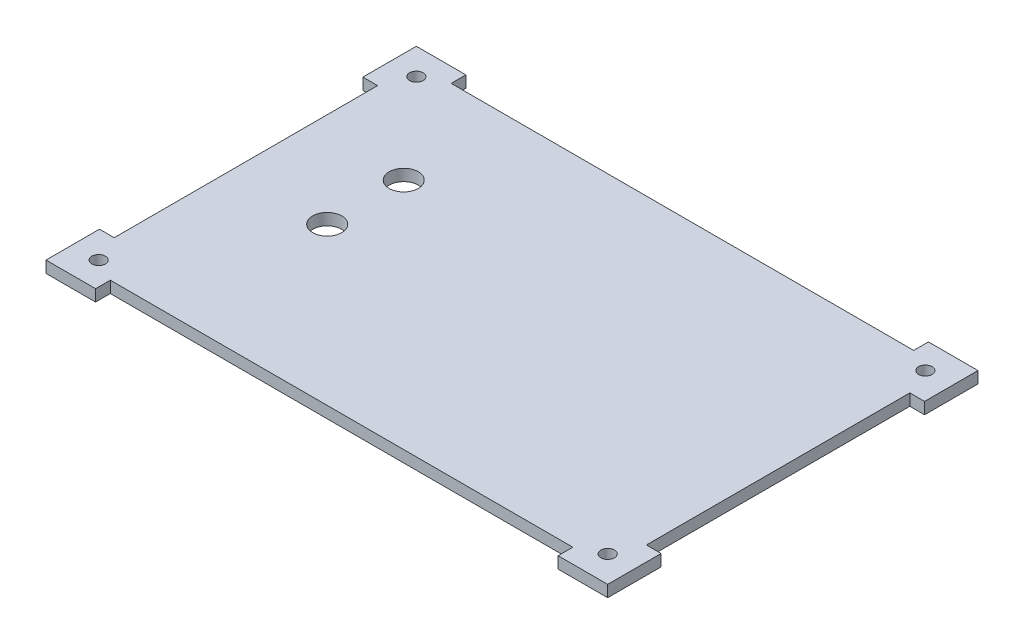
ISO-10303-21;
HEADER;
FILE_DESCRIPTION(('STEP AP214'),'2;1');
FILE_NAME('part.step','',(''),(''),'','','');
FILE_SCHEMA(('AUTOMOTIVE_DESIGN { 1 0 10303 214 1 1 1 1 }'));
ENDSEC;
DATA;
#1=APPLICATION_CONTEXT('core data for automotive mechanical design processes');
#2=APPLICATION_PROTOCOL_DEFINITION('international standard','automotive_design',2000,#1);
#3=PRODUCT_CONTEXT('',#1,'mechanical');
#4=PRODUCT('Part','Part','',(#3));
#5=PRODUCT_RELATED_PRODUCT_CATEGORY('part','',(#4));
#6=PRODUCT_DEFINITION_FORMATION('','',#4);
#7=PRODUCT_DEFINITION_CONTEXT('part definition',#1,'design');
#8=PRODUCT_DEFINITION('design','',#6,#7);
#9=PRODUCT_DEFINITION_SHAPE('','',#8);
#10=(LENGTH_UNIT() NAMED_UNIT(*) SI_UNIT(.MILLI.,.METRE.));
#11=(NAMED_UNIT(*) PLANE_ANGLE_UNIT() SI_UNIT($,.RADIAN.));
#12=(NAMED_UNIT(*) SI_UNIT($,.STERADIAN.) SOLID_ANGLE_UNIT());
#13=UNCERTAINTY_MEASURE_WITH_UNIT(LENGTH_MEASURE(1.E-05),#10,'distance_accuracy_value','');
#14=(GEOMETRIC_REPRESENTATION_CONTEXT(3) GLOBAL_UNCERTAINTY_ASSIGNED_CONTEXT((#13)) GLOBAL_UNIT_ASSIGNED_CONTEXT((#10,
#11,#12)) REPRESENTATION_CONTEXT('',''));
#15=CARTESIAN_POINT('',(0.,0.,0.));
#16=DIRECTION('',(0.,0.,1.));
#17=DIRECTION('',(1.,0.,0.));
#18=AXIS2_PLACEMENT_3D('',#15,#16,#17);
#19=CARTESIAN_POINT('',(0.,3.,88.));
#20=DIRECTION('',(0.,0.,-1.));
#21=DIRECTION('',(-1.,0.,0.));
#22=AXIS2_PLACEMENT_3D('',#19,#20,#21);
#23=PLANE('',#22);
#24=DIRECTION('',(0.,-1.,0.));
#25=VECTOR('',#24,1.);
#26=CARTESIAN_POINT('',(128.4,3.,88.));
#27=LINE('',#26,#25);
#28=CARTESIAN_POINT('',(128.4,3.,88.));
#29=VERTEX_POINT('',#28);
#30=CARTESIAN_POINT('',(128.4,0.,88.));
#31=VERTEX_POINT('',#30);
#32=EDGE_CURVE('E65',#29,#31,#27,.T.);
#33=ORIENTED_EDGE('',*,*,#32,.F.);
#34=DIRECTION('',(1.,0.,0.));
#35=VECTOR('',#34,1.);
#36=CARTESIAN_POINT('',(0.,3.,88.));
#37=LINE('',#36,#35);
#38=CARTESIAN_POINT('',(9.,3.,88.));
#39=VERTEX_POINT('',#38);
#40=EDGE_CURVE('E413',#39,#29,#37,.T.);
#41=ORIENTED_EDGE('',*,*,#40,.F.);
#42=DIRECTION('',(0.,-1.,0.));
#43=VECTOR('',#42,1.);
#44=CARTESIAN_POINT('',(9.,3.,88.));
#45=LINE('',#44,#43);
#46=CARTESIAN_POINT('',(9.,0.,88.));
#47=VERTEX_POINT('',#46);
#48=EDGE_CURVE('E350',#39,#47,#45,.T.);
#49=ORIENTED_EDGE('',*,*,#48,.T.);
#50=DIRECTION('',(1.,0.,0.));
#51=VECTOR('',#50,1.);
#52=CARTESIAN_POINT('',(0.,0.,88.));
#53=LINE('',#52,#51);
#54=EDGE_CURVE('E226',#47,#31,#53,.T.);
#55=ORIENTED_EDGE('',*,*,#54,.T.);
#56=EDGE_LOOP('',(#33,#41,#49,#55));
#57=FACE_BOUND('',#56,.T.);
#58=ADVANCED_FACE('F40',(#57),#23,.F.);
#59=CARTESIAN_POINT('',(137.4,3.,0.));
#60=DIRECTION('',(-1.,0.,0.));
#61=DIRECTION('',(0.,0.,1.));
#62=AXIS2_PLACEMENT_3D('',#59,#60,#61);
#63=PLANE('',#62);
#64=DIRECTION('',(0.,0.,-1.));
#65=VECTOR('',#64,1.);
#66=CARTESIAN_POINT('',(137.4,3.,0.));
#67=LINE('',#66,#65);
#68=CARTESIAN_POINT('',(137.4,3.,78.));
#69=VERTEX_POINT('',#68);
#70=CARTESIAN_POINT('',(137.4,3.,10.));
#71=VERTEX_POINT('',#70);
#72=EDGE_CURVE('E50',#69,#71,#67,.T.);
#73=ORIENTED_EDGE('',*,*,#72,.F.);
#74=DIRECTION('',(0.,-1.,0.));
#75=VECTOR('',#74,1.);
#76=CARTESIAN_POINT('',(137.4,3.,78.));
#77=LINE('',#76,#75);
#78=CARTESIAN_POINT('',(137.4,0.,78.));
#79=VERTEX_POINT('',#78);
#80=EDGE_CURVE('E198',#69,#79,#77,.T.);
#81=ORIENTED_EDGE('',*,*,#80,.T.);
#82=DIRECTION('',(0.,0.,-1.));
#83=VECTOR('',#82,1.);
#84=CARTESIAN_POINT('',(137.4,0.,0.));
#85=LINE('',#84,#83);
#86=CARTESIAN_POINT('',(137.4,0.,10.));
#87=VERTEX_POINT('',#86);
#88=EDGE_CURVE('E230',#79,#87,#85,.T.);
#89=ORIENTED_EDGE('',*,*,#88,.T.);
#90=DIRECTION('',(0.,-1.,0.));
#91=VECTOR('',#90,1.);
#92=CARTESIAN_POINT('',(137.4,3.,10.));
#93=LINE('',#92,#91);
#94=EDGE_CURVE('E283',#71,#87,#93,.T.);
#95=ORIENTED_EDGE('',*,*,#94,.F.);
#96=EDGE_LOOP('',(#73,#81,#89,#95));
#97=FACE_BOUND('',#96,.T.);
#98=ADVANCED_FACE('F417',(#97),#63,.F.);
#99=CARTESIAN_POINT('',(0.,3.,0.));
#100=DIRECTION('',(0.,0.,1.));
#101=DIRECTION('',(1.,0.,0.));
#102=AXIS2_PLACEMENT_3D('',#99,#100,#101);
#103=PLANE('',#102);
#104=DIRECTION('',(-1.,0.,0.));
#105=VECTOR('',#104,1.);
#106=CARTESIAN_POINT('',(0.,3.,0.));
#107=LINE('',#106,#105);
#108=CARTESIAN_POINT('',(128.4,3.,0.));
#109=VERTEX_POINT('',#108);
#110=CARTESIAN_POINT('',(9.,3.,0.));
#111=VERTEX_POINT('',#110);
#112=EDGE_CURVE('E12',#109,#111,#107,.T.);
#113=ORIENTED_EDGE('',*,*,#112,.F.);
#114=DIRECTION('',(0.,-1.,0.));
#115=VECTOR('',#114,1.);
#116=CARTESIAN_POINT('',(128.4,3.,0.));
#117=LINE('',#116,#115);
#118=CARTESIAN_POINT('',(128.4,0.,0.));
#119=VERTEX_POINT('',#118);
#120=EDGE_CURVE('E261',#109,#119,#117,.T.);
#121=ORIENTED_EDGE('',*,*,#120,.T.);
#122=DIRECTION('',(-1.,0.,0.));
#123=VECTOR('',#122,1.);
#124=CARTESIAN_POINT('',(0.,0.,0.));
#125=LINE('',#124,#123);
#126=CARTESIAN_POINT('',(9.,0.,0.));
#127=VERTEX_POINT('',#126);
#128=EDGE_CURVE('E44',#119,#127,#125,.T.);
#129=ORIENTED_EDGE('',*,*,#128,.T.);
#130=DIRECTION('',(0.,-1.,0.));
#131=VECTOR('',#130,1.);
#132=CARTESIAN_POINT('',(9.,3.,0.));
#133=LINE('',#132,#131);
#134=EDGE_CURVE('E333',#111,#127,#133,.T.);
#135=ORIENTED_EDGE('',*,*,#134,.F.);
#136=EDGE_LOOP('',(#113,#121,#129,#135));
#137=FACE_BOUND('',#136,.T.);
#138=ADVANCED_FACE('F440',(#137),#103,.F.);
#139=CARTESIAN_POINT('',(0.,3.,0.));
#140=DIRECTION('',(1.,0.,0.));
#141=DIRECTION('',(0.,0.,-1.));
#142=AXIS2_PLACEMENT_3D('',#139,#140,#141);
#143=PLANE('',#142);
#144=DIRECTION('',(0.,0.,1.));
#145=VECTOR('',#144,1.);
#146=CARTESIAN_POINT('',(0.,3.,0.));
#147=LINE('',#146,#145);
#148=CARTESIAN_POINT('',(0.,3.,10.));
#149=VERTEX_POINT('',#148);
#150=CARTESIAN_POINT('',(0.,3.,78.));
#151=VERTEX_POINT('',#150);
#152=EDGE_CURVE('E411',#149,#151,#147,.T.);
#153=ORIENTED_EDGE('',*,*,#152,.F.);
#154=DIRECTION('',(0.,-1.,0.));
#155=VECTOR('',#154,1.);
#156=CARTESIAN_POINT('',(0.,3.,10.));
#157=LINE('',#156,#155);
#158=CARTESIAN_POINT('',(0.,0.,10.));
#159=VERTEX_POINT('',#158);
#160=EDGE_CURVE('E331',#149,#159,#157,.T.);
#161=ORIENTED_EDGE('',*,*,#160,.T.);
#162=DIRECTION('',(0.,0.,1.));
#163=VECTOR('',#162,1.);
#164=CARTESIAN_POINT('',(0.,0.,0.));
#165=LINE('',#164,#163);
#166=CARTESIAN_POINT('',(0.,0.,78.));
#167=VERTEX_POINT('',#166);
#168=EDGE_CURVE('E231',#159,#167,#165,.T.);
#169=ORIENTED_EDGE('',*,*,#168,.T.);
#170=DIRECTION('',(0.,-1.,0.));
#171=VECTOR('',#170,1.);
#172=CARTESIAN_POINT('',(0.,3.,78.));
#173=LINE('',#172,#171);
#174=EDGE_CURVE('E368',#151,#167,#173,.T.);
#175=ORIENTED_EDGE('',*,*,#174,.F.);
#176=EDGE_LOOP('',(#153,#161,#169,#175));
#177=FACE_BOUND('',#176,.T.);
#178=ADVANCED_FACE('F42',(#177),#143,.F.);
#179=CARTESIAN_POINT('',(0.,3.,0.));
#180=DIRECTION('',(0.,1.,0.));
#181=DIRECTION('',(0.,0.,1.));
#182=AXIS2_PLACEMENT_3D('',#179,#180,#181);
#183=PLANE('',#182);
#184=CARTESIAN_POINT('',(24.5,3.,47.5));
#185=DIRECTION('',(0.,-1.,0.));
#186=DIRECTION('',(0.,0.,-1.));
#187=AXIS2_PLACEMENT_3D('',#184,#185,#186);
#188=CIRCLE('',#187,3.75);
#189=CARTESIAN_POINT('',(24.5,3.,43.75));
#190=VERTEX_POINT('',#189);
#191=EDGE_CURVE('E214',#190,#190,#188,.T.);
#192=ORIENTED_EDGE('',*,*,#191,.T.);
#193=EDGE_LOOP('',(#192));
#194=FACE_BOUND('',#193,.T.);
#195=CARTESIAN_POINT('',(24.5,3.,27.75));
#196=DIRECTION('',(0.,-1.,0.));
#197=DIRECTION('',(0.,0.,-1.));
#198=AXIS2_PLACEMENT_3D('',#195,#196,#197);
#199=CIRCLE('',#198,3.75);
#200=CARTESIAN_POINT('',(24.5,3.,24.));
#201=VERTEX_POINT('',#200);
#202=EDGE_CURVE('E458',#201,#201,#199,.T.);
#203=ORIENTED_EDGE('',*,*,#202,.T.);
#204=EDGE_LOOP('',(#203));
#205=FACE_BOUND('',#204,.T.);
#206=DIRECTION('',(1.,0.,0.));
#207=VECTOR('',#206,1.);
#208=CARTESIAN_POINT('',(0.,3.,78.));
#209=LINE('',#208,#207);
#210=CARTESIAN_POINT('',(141.2,3.,78.));
#211=VERTEX_POINT('',#210);
#212=EDGE_CURVE('E184',#69,#211,#209,.T.);
#213=ORIENTED_EDGE('',*,*,#212,.F.);
#214=ORIENTED_EDGE('',*,*,#72,.T.);
#215=DIRECTION('',(1.,0.,0.));
#216=VECTOR('',#215,1.);
#217=CARTESIAN_POINT('',(0.,3.,10.));
#218=LINE('',#217,#216);
#219=CARTESIAN_POINT('',(141.2,3.,10.));
#220=VERTEX_POINT('',#219);
#221=EDGE_CURVE('E259',#71,#220,#218,.T.);
#222=ORIENTED_EDGE('',*,*,#221,.T.);
#223=DIRECTION('',(0.,0.,-1.));
#224=VECTOR('',#223,1.);
#225=CARTESIAN_POINT('',(141.2,3.,0.));
#226=LINE('',#225,#224);
#227=CARTESIAN_POINT('',(141.2,3.,-3.8));
#228=VERTEX_POINT('',#227);
#229=EDGE_CURVE('E257',#220,#228,#226,.T.);
#230=ORIENTED_EDGE('',*,*,#229,.T.);
#231=DIRECTION('',(-1.,0.,0.));
#232=VECTOR('',#231,1.);
#233=CARTESIAN_POINT('',(0.,3.,-3.80000000000002));
#234=LINE('',#233,#232);
#235=CARTESIAN_POINT('',(128.4,3.,-3.8));
#236=VERTEX_POINT('',#235);
#237=EDGE_CURVE('E254',#228,#236,#234,.T.);
#238=ORIENTED_EDGE('',*,*,#237,.T.);
#239=DIRECTION('',(0.,0.,-1.));
#240=VECTOR('',#239,1.);
#241=CARTESIAN_POINT('',(128.4,3.,0.));
#242=LINE('',#241,#240);
#243=EDGE_CURVE('E251',#109,#236,#242,.T.);
#244=ORIENTED_EDGE('',*,*,#243,.F.);
#245=ORIENTED_EDGE('',*,*,#112,.T.);
#246=DIRECTION('',(0.,0.,-1.));
#247=VECTOR('',#246,1.);
#248=CARTESIAN_POINT('',(9.,3.,0.));
#249=LINE('',#248,#247);
#250=CARTESIAN_POINT('',(9.,3.,-3.8));
#251=VERTEX_POINT('',#250);
#252=EDGE_CURVE('E302',#111,#251,#249,.T.);
#253=ORIENTED_EDGE('',*,*,#252,.T.);
#254=DIRECTION('',(1.,0.,0.));
#255=VECTOR('',#254,1.);
#256=CARTESIAN_POINT('',(0.,3.,-3.8));
#257=LINE('',#256,#255);
#258=CARTESIAN_POINT('',(-3.8,3.,-3.8));
#259=VERTEX_POINT('',#258);
#260=EDGE_CURVE('E298',#259,#251,#257,.T.);
#261=ORIENTED_EDGE('',*,*,#260,.F.);
#262=DIRECTION('',(0.,0.,1.));
#263=VECTOR('',#262,1.);
#264=CARTESIAN_POINT('',(-3.8,3.,0.));
#265=LINE('',#264,#263);
#266=CARTESIAN_POINT('',(-3.8,3.,10.));
#267=VERTEX_POINT('',#266);
#268=EDGE_CURVE('E296',#259,#267,#265,.T.);
#269=ORIENTED_EDGE('',*,*,#268,.T.);
#270=DIRECTION('',(-1.,0.,0.));
#271=VECTOR('',#270,1.);
#272=CARTESIAN_POINT('',(0.,3.,10.));
#273=LINE('',#272,#271);
#274=EDGE_CURVE('E304',#149,#267,#273,.T.);
#275=ORIENTED_EDGE('',*,*,#274,.F.);
#276=ORIENTED_EDGE('',*,*,#152,.T.);
#277=DIRECTION('',(1.,0.,0.));
#278=VECTOR('',#277,1.);
#279=CARTESIAN_POINT('',(0.,3.,78.));
#280=LINE('',#279,#278);
#281=CARTESIAN_POINT('',(-3.8,3.,78.));
#282=VERTEX_POINT('',#281);
#283=EDGE_CURVE('E348',#282,#151,#280,.T.);
#284=ORIENTED_EDGE('',*,*,#283,.F.);
#285=DIRECTION('',(0.,0.,-1.));
#286=VECTOR('',#285,1.);
#287=CARTESIAN_POINT('',(-3.79999999999999,3.,0.));
#288=LINE('',#287,#286);
#289=CARTESIAN_POINT('',(-3.8,3.,91.8));
#290=VERTEX_POINT('',#289);
#291=EDGE_CURVE('E345',#290,#282,#288,.T.);
#292=ORIENTED_EDGE('',*,*,#291,.F.);
#293=DIRECTION('',(1.,0.,0.));
#294=VECTOR('',#293,1.);
#295=CARTESIAN_POINT('',(0.,3.,91.8));
#296=LINE('',#295,#294);
#297=CARTESIAN_POINT('',(9.,3.,91.8));
#298=VERTEX_POINT('',#297);
#299=EDGE_CURVE('E342',#290,#298,#296,.T.);
#300=ORIENTED_EDGE('',*,*,#299,.T.);
#301=DIRECTION('',(0.,0.,-1.));
#302=VECTOR('',#301,1.);
#303=CARTESIAN_POINT('',(9.00000000000004,3.,0.));
#304=LINE('',#303,#302);
#305=EDGE_CURVE('E339',#298,#39,#304,.T.);
#306=ORIENTED_EDGE('',*,*,#305,.T.);
#307=ORIENTED_EDGE('',*,*,#40,.T.);
#308=DIRECTION('',(0.,0.,1.));
#309=VECTOR('',#308,1.);
#310=CARTESIAN_POINT('',(128.4,3.,0.));
#311=LINE('',#310,#309);
#312=CARTESIAN_POINT('',(128.4,3.,91.8));
#313=VERTEX_POINT('',#312);
#314=EDGE_CURVE('E201',#29,#313,#311,.T.);
#315=ORIENTED_EDGE('',*,*,#314,.T.);
#316=DIRECTION('',(-1.,0.,0.));
#317=VECTOR('',#316,1.);
#318=CARTESIAN_POINT('',(0.,3.,91.8));
#319=LINE('',#318,#317);
#320=CARTESIAN_POINT('',(141.2,3.,91.8));
#321=VERTEX_POINT('',#320);
#322=EDGE_CURVE('E186',#321,#313,#319,.T.);
#323=ORIENTED_EDGE('',*,*,#322,.F.);
#324=DIRECTION('',(0.,0.,-1.));
#325=VECTOR('',#324,1.);
#326=CARTESIAN_POINT('',(141.2,3.,0.));
#327=LINE('',#326,#325);
#328=EDGE_CURVE('E179',#321,#211,#327,.T.);
#329=ORIENTED_EDGE('',*,*,#328,.T.);
#330=EDGE_LOOP('',(#213,#214,#222,#230,#238,#244,#245,#253,#261,#269,#275,#276,#284,#292,#300,
#306,#307,#315,#323,#329));
#331=FACE_BOUND('',#330,.T.);
#332=CARTESIAN_POINT('',(3.,3.,3.));
#333=DIRECTION('',(0.,-1.,0.));
#334=DIRECTION('',(0.,0.,-1.));
#335=AXIS2_PLACEMENT_3D('',#332,#333,#334);
#336=CIRCLE('',#335,1.75);
#337=CARTESIAN_POINT('',(3.,3.,1.25));
#338=VERTEX_POINT('',#337);
#339=EDGE_CURVE('E399',#338,#338,#336,.T.);
#340=ORIENTED_EDGE('',*,*,#339,.T.);
#341=EDGE_LOOP('',(#340));
#342=FACE_BOUND('',#341,.T.);
#343=CARTESIAN_POINT('',(134.4,3.,3.));
#344=DIRECTION('',(0.,-1.,0.));
#345=DIRECTION('',(0.,0.,-1.));
#346=AXIS2_PLACEMENT_3D('',#343,#344,#345);
#347=CIRCLE('',#346,1.75000000000001);
#348=CARTESIAN_POINT('',(134.4,3.,1.24999999999999));
#349=VERTEX_POINT('',#348);
#350=EDGE_CURVE('E390',#349,#349,#347,.T.);
#351=ORIENTED_EDGE('',*,*,#350,.T.);
#352=EDGE_LOOP('',(#351));
#353=FACE_BOUND('',#352,.T.);
#354=CARTESIAN_POINT('',(134.4,3.,85.));
#355=DIRECTION('',(0.,-1.,0.));
#356=DIRECTION('',(0.,0.,-1.));
#357=AXIS2_PLACEMENT_3D('',#354,#355,#356);
#358=CIRCLE('',#357,1.75000000000001);
#359=CARTESIAN_POINT('',(134.4,3.,83.25));
#360=VERTEX_POINT('',#359);
#361=EDGE_CURVE('E381',#360,#360,#358,.T.);
#362=ORIENTED_EDGE('',*,*,#361,.T.);
#363=EDGE_LOOP('',(#362));
#364=FACE_BOUND('',#363,.T.);
#365=CARTESIAN_POINT('',(3.,3.,85.));
#366=DIRECTION('',(0.,-1.,0.));
#367=DIRECTION('',(0.,0.,-1.));
#368=AXIS2_PLACEMENT_3D('',#365,#366,#367);
#369=CIRCLE('',#368,1.75);
#370=CARTESIAN_POINT('',(3.,3.,83.25));
#371=VERTEX_POINT('',#370);
#372=EDGE_CURVE('E405',#371,#371,#369,.T.);
#373=ORIENTED_EDGE('',*,*,#372,.T.);
#374=EDGE_LOOP('',(#373));
#375=FACE_BOUND('',#374,.T.);
#376=ADVANCED_FACE('F181',(#194,#205,#331,#342,#353,#364,#375),#183,.T.);
#377=CARTESIAN_POINT('',(0.,0.,0.));
#378=DIRECTION('',(0.,1.,0.));
#379=DIRECTION('',(0.,0.,1.));
#380=AXIS2_PLACEMENT_3D('',#377,#378,#379);
#381=PLANE('',#380);
#382=CARTESIAN_POINT('',(24.5,0.,47.5));
#383=DIRECTION('',(0.,-1.,0.));
#384=DIRECTION('',(0.,0.,-1.));
#385=AXIS2_PLACEMENT_3D('',#382,#383,#384);
#386=CIRCLE('',#385,3.75);
#387=CARTESIAN_POINT('',(24.5,0.,43.75));
#388=VERTEX_POINT('',#387);
#389=EDGE_CURVE('E459',#388,#388,#386,.T.);
#390=ORIENTED_EDGE('',*,*,#389,.F.);
#391=EDGE_LOOP('',(#390));
#392=FACE_BOUND('',#391,.T.);
#393=CARTESIAN_POINT('',(24.5,0.,27.75));
#394=DIRECTION('',(0.,-1.,0.));
#395=DIRECTION('',(0.,0.,-1.));
#396=AXIS2_PLACEMENT_3D('',#393,#394,#395);
#397=CIRCLE('',#396,3.75);
#398=CARTESIAN_POINT('',(24.5,0.,24.));
#399=VERTEX_POINT('',#398);
#400=EDGE_CURVE('E455',#399,#399,#397,.T.);
#401=ORIENTED_EDGE('',*,*,#400,.F.);
#402=EDGE_LOOP('',(#401));
#403=FACE_BOUND('',#402,.T.);
#404=ORIENTED_EDGE('',*,*,#88,.F.);
#405=DIRECTION('',(1.,0.,0.));
#406=VECTOR('',#405,1.);
#407=CARTESIAN_POINT('',(0.,0.,78.));
#408=LINE('',#407,#406);
#409=CARTESIAN_POINT('',(141.2,0.,78.));
#410=VERTEX_POINT('',#409);
#411=EDGE_CURVE('E213',#79,#410,#408,.T.);
#412=ORIENTED_EDGE('',*,*,#411,.T.);
#413=DIRECTION('',(0.,0.,-1.));
#414=VECTOR('',#413,1.);
#415=CARTESIAN_POINT('',(141.2,0.,0.));
#416=LINE('',#415,#414);
#417=CARTESIAN_POINT('',(141.2,0.,91.8));
#418=VERTEX_POINT('',#417);
#419=EDGE_CURVE('E193',#418,#410,#416,.T.);
#420=ORIENTED_EDGE('',*,*,#419,.F.);
#421=DIRECTION('',(-1.,0.,0.));
#422=VECTOR('',#421,1.);
#423=CARTESIAN_POINT('',(0.,0.,91.8));
#424=LINE('',#423,#422);
#425=CARTESIAN_POINT('',(128.4,0.,91.8));
#426=VERTEX_POINT('',#425);
#427=EDGE_CURVE('E203',#418,#426,#424,.T.);
#428=ORIENTED_EDGE('',*,*,#427,.T.);
#429=DIRECTION('',(0.,0.,1.));
#430=VECTOR('',#429,1.);
#431=CARTESIAN_POINT('',(128.4,0.,0.));
#432=LINE('',#431,#430);
#433=EDGE_CURVE('E208',#31,#426,#432,.T.);
#434=ORIENTED_EDGE('',*,*,#433,.F.);
#435=ORIENTED_EDGE('',*,*,#54,.F.);
#436=DIRECTION('',(0.,0.,-1.));
#437=VECTOR('',#436,1.);
#438=CARTESIAN_POINT('',(9.00000000000004,0.,0.));
#439=LINE('',#438,#437);
#440=CARTESIAN_POINT('',(9.,0.,91.8));
#441=VERTEX_POINT('',#440);
#442=EDGE_CURVE('E330',#441,#47,#439,.T.);
#443=ORIENTED_EDGE('',*,*,#442,.F.);
#444=DIRECTION('',(1.,0.,0.));
#445=VECTOR('',#444,1.);
#446=CARTESIAN_POINT('',(0.,0.,91.8));
#447=LINE('',#446,#445);
#448=CARTESIAN_POINT('',(-3.8,0.,91.8));
#449=VERTEX_POINT('',#448);
#450=EDGE_CURVE('E355',#449,#441,#447,.T.);
#451=ORIENTED_EDGE('',*,*,#450,.F.);
#452=DIRECTION('',(0.,0.,-1.));
#453=VECTOR('',#452,1.);
#454=CARTESIAN_POINT('',(-3.79999999999999,0.,0.));
#455=LINE('',#454,#453);
#456=CARTESIAN_POINT('',(-3.8,0.,78.));
#457=VERTEX_POINT('',#456);
#458=EDGE_CURVE('E359',#449,#457,#455,.T.);
#459=ORIENTED_EDGE('',*,*,#458,.T.);
#460=DIRECTION('',(1.,0.,0.));
#461=VECTOR('',#460,1.);
#462=CARTESIAN_POINT('',(0.,0.,78.));
#463=LINE('',#462,#461);
#464=EDGE_CURVE('E343',#457,#167,#463,.T.);
#465=ORIENTED_EDGE('',*,*,#464,.T.);
#466=ORIENTED_EDGE('',*,*,#168,.F.);
#467=DIRECTION('',(-1.,0.,0.));
#468=VECTOR('',#467,1.);
#469=CARTESIAN_POINT('',(0.,0.,10.));
#470=LINE('',#469,#468);
#471=CARTESIAN_POINT('',(-3.8,0.,10.));
#472=VERTEX_POINT('',#471);
#473=EDGE_CURVE('E299',#159,#472,#470,.T.);
#474=ORIENTED_EDGE('',*,*,#473,.T.);
#475=DIRECTION('',(0.,0.,1.));
#476=VECTOR('',#475,1.);
#477=CARTESIAN_POINT('',(-3.8,0.,0.));
#478=LINE('',#477,#476);
#479=CARTESIAN_POINT('',(-3.8,0.,-3.8));
#480=VERTEX_POINT('',#479);
#481=EDGE_CURVE('E286',#480,#472,#478,.T.);
#482=ORIENTED_EDGE('',*,*,#481,.F.);
#483=DIRECTION('',(1.,0.,0.));
#484=VECTOR('',#483,1.);
#485=CARTESIAN_POINT('',(0.,0.,-3.8));
#486=LINE('',#485,#484);
#487=CARTESIAN_POINT('',(9.,0.,-3.8));
#488=VERTEX_POINT('',#487);
#489=EDGE_CURVE('E312',#480,#488,#486,.T.);
#490=ORIENTED_EDGE('',*,*,#489,.T.);
#491=DIRECTION('',(0.,0.,-1.));
#492=VECTOR('',#491,1.);
#493=CARTESIAN_POINT('',(9.,0.,0.));
#494=LINE('',#493,#492);
#495=EDGE_CURVE('E320',#127,#488,#494,.T.);
#496=ORIENTED_EDGE('',*,*,#495,.F.);
#497=ORIENTED_EDGE('',*,*,#128,.F.);
#498=DIRECTION('',(0.,0.,-1.));
#499=VECTOR('',#498,1.);
#500=CARTESIAN_POINT('',(128.4,0.,0.));
#501=LINE('',#500,#499);
#502=CARTESIAN_POINT('',(128.4,0.,-3.8));
#503=VERTEX_POINT('',#502);
#504=EDGE_CURVE('E247',#119,#503,#501,.T.);
#505=ORIENTED_EDGE('',*,*,#504,.T.);
#506=DIRECTION('',(-1.,0.,0.));
#507=VECTOR('',#506,1.);
#508=CARTESIAN_POINT('',(0.,0.,-3.80000000000002));
#509=LINE('',#508,#507);
#510=CARTESIAN_POINT('',(141.2,0.,-3.8));
#511=VERTEX_POINT('',#510);
#512=EDGE_CURVE('E266',#511,#503,#509,.T.);
#513=ORIENTED_EDGE('',*,*,#512,.F.);
#514=DIRECTION('',(0.,0.,-1.));
#515=VECTOR('',#514,1.);
#516=CARTESIAN_POINT('',(141.2,0.,0.));
#517=LINE('',#516,#515);
#518=CARTESIAN_POINT('',(141.2,0.,10.));
#519=VERTEX_POINT('',#518);
#520=EDGE_CURVE('E277',#519,#511,#517,.T.);
#521=ORIENTED_EDGE('',*,*,#520,.F.);
#522=DIRECTION('',(1.,0.,0.));
#523=VECTOR('',#522,1.);
#524=CARTESIAN_POINT('',(0.,0.,10.));
#525=LINE('',#524,#523);
#526=EDGE_CURVE('E255',#87,#519,#525,.T.);
#527=ORIENTED_EDGE('',*,*,#526,.F.);
#528=EDGE_LOOP('',(#404,#412,#420,#428,#434,#435,#443,#451,#459,#465,#466,#474,#482,#490,#496,
#497,#505,#513,#521,#527));
#529=FACE_BOUND('',#528,.T.);
#530=CARTESIAN_POINT('',(3.,0.,3.));
#531=DIRECTION('',(0.,-1.,0.));
#532=DIRECTION('',(0.,0.,-1.));
#533=AXIS2_PLACEMENT_3D('',#530,#531,#532);
#534=CIRCLE('',#533,1.75);
#535=CARTESIAN_POINT('',(3.,0.,1.25));
#536=VERTEX_POINT('',#535);
#537=EDGE_CURVE('E371',#536,#536,#534,.T.);
#538=ORIENTED_EDGE('',*,*,#537,.F.);
#539=EDGE_LOOP('',(#538));
#540=FACE_BOUND('',#539,.T.);
#541=CARTESIAN_POINT('',(134.4,0.,3.));
#542=DIRECTION('',(0.,-1.,0.));
#543=DIRECTION('',(0.,0.,-1.));
#544=AXIS2_PLACEMENT_3D('',#541,#542,#543);
#545=CIRCLE('',#544,1.75000000000001);
#546=CARTESIAN_POINT('',(134.4,0.,1.24999999999999));
#547=VERTEX_POINT('',#546);
#548=EDGE_CURVE('E394',#547,#547,#545,.T.);
#549=ORIENTED_EDGE('',*,*,#548,.F.);
#550=EDGE_LOOP('',(#549));
#551=FACE_BOUND('',#550,.T.);
#552=CARTESIAN_POINT('',(134.4,0.,85.));
#553=DIRECTION('',(0.,-1.,0.));
#554=DIRECTION('',(0.,0.,-1.));
#555=AXIS2_PLACEMENT_3D('',#552,#553,#554);
#556=CIRCLE('',#555,1.75000000000001);
#557=CARTESIAN_POINT('',(134.4,0.,83.25));
#558=VERTEX_POINT('',#557);
#559=EDGE_CURVE('E385',#558,#558,#556,.T.);
#560=ORIENTED_EDGE('',*,*,#559,.F.);
#561=EDGE_LOOP('',(#560));
#562=FACE_BOUND('',#561,.T.);
#563=CARTESIAN_POINT('',(3.,0.,85.));
#564=DIRECTION('',(0.,-1.,0.));
#565=DIRECTION('',(0.,0.,-1.));
#566=AXIS2_PLACEMENT_3D('',#563,#564,#565);
#567=CIRCLE('',#566,1.75);
#568=CARTESIAN_POINT('',(3.,0.,83.25));
#569=VERTEX_POINT('',#568);
#570=EDGE_CURVE('E384',#569,#569,#567,.T.);
#571=ORIENTED_EDGE('',*,*,#570,.F.);
#572=EDGE_LOOP('',(#571));
#573=FACE_BOUND('',#572,.T.);
#574=ADVANCED_FACE('F444',(#392,#403,#529,#540,#551,#562,#573),#381,.F.);
#575=CARTESIAN_POINT('',(3.,3.,85.));
#576=DIRECTION('',(0.,-1.,0.));
#577=DIRECTION('',(0.,0.,-1.));
#578=AXIS2_PLACEMENT_3D('',#575,#576,#577);
#579=CYLINDRICAL_SURFACE('',#578,1.75);
#580=ORIENTED_EDGE('',*,*,#372,.F.);
#581=EDGE_LOOP('',(#580));
#582=FACE_BOUND('',#581,.T.);
#583=ORIENTED_EDGE('',*,*,#570,.T.);
#584=EDGE_LOOP('',(#583));
#585=FACE_BOUND('',#584,.T.);
#586=ADVANCED_FACE('F481',(#582,#585),#579,.F.);
#587=CARTESIAN_POINT('',(134.4,3.,85.));
#588=DIRECTION('',(0.,-1.,0.));
#589=DIRECTION('',(0.,0.,-1.));
#590=AXIS2_PLACEMENT_3D('',#587,#588,#589);
#591=CYLINDRICAL_SURFACE('',#590,1.75000000000001);
#592=ORIENTED_EDGE('',*,*,#361,.F.);
#593=EDGE_LOOP('',(#592));
#594=FACE_BOUND('',#593,.T.);
#595=ORIENTED_EDGE('',*,*,#559,.T.);
#596=EDGE_LOOP('',(#595));
#597=FACE_BOUND('',#596,.T.);
#598=ADVANCED_FACE('F488',(#594,#597),#591,.F.);
#599=CARTESIAN_POINT('',(134.4,3.,3.));
#600=DIRECTION('',(0.,-1.,0.));
#601=DIRECTION('',(0.,0.,-1.));
#602=AXIS2_PLACEMENT_3D('',#599,#600,#601);
#603=CYLINDRICAL_SURFACE('',#602,1.75000000000001);
#604=ORIENTED_EDGE('',*,*,#350,.F.);
#605=EDGE_LOOP('',(#604));
#606=FACE_BOUND('',#605,.T.);
#607=ORIENTED_EDGE('',*,*,#548,.T.);
#608=EDGE_LOOP('',(#607));
#609=FACE_BOUND('',#608,.T.);
#610=ADVANCED_FACE('F589',(#606,#609),#603,.F.);
#611=CARTESIAN_POINT('',(3.,3.,3.));
#612=DIRECTION('',(0.,-1.,0.));
#613=DIRECTION('',(0.,0.,-1.));
#614=AXIS2_PLACEMENT_3D('',#611,#612,#613);
#615=CYLINDRICAL_SURFACE('',#614,1.75);
#616=ORIENTED_EDGE('',*,*,#339,.F.);
#617=EDGE_LOOP('',(#616));
#618=FACE_BOUND('',#617,.T.);
#619=ORIENTED_EDGE('',*,*,#537,.T.);
#620=EDGE_LOOP('',(#619));
#621=FACE_BOUND('',#620,.T.);
#622=ADVANCED_FACE('F580',(#618,#621),#615,.F.);
#623=CARTESIAN_POINT('',(0.,3.,78.));
#624=DIRECTION('',(0.,0.,-1.));
#625=DIRECTION('',(-1.,0.,0.));
#626=AXIS2_PLACEMENT_3D('',#623,#624,#625);
#627=PLANE('',#626);
#628=ORIENTED_EDGE('',*,*,#464,.F.);
#629=DIRECTION('',(0.,-1.,0.));
#630=VECTOR('',#629,1.);
#631=CARTESIAN_POINT('',(-3.8,3.,78.));
#632=LINE('',#631,#630);
#633=EDGE_CURVE('E372',#282,#457,#632,.T.);
#634=ORIENTED_EDGE('',*,*,#633,.F.);
#635=ORIENTED_EDGE('',*,*,#283,.T.);
#636=ORIENTED_EDGE('',*,*,#174,.T.);
#637=EDGE_LOOP('',(#628,#634,#635,#636));
#638=FACE_BOUND('',#637,.T.);
#639=ADVANCED_FACE('F523',(#638),#627,.T.);
#640=CARTESIAN_POINT('',(-3.79999999999999,3.,0.));
#641=DIRECTION('',(-1.,0.,0.));
#642=DIRECTION('',(0.,0.,1.));
#643=AXIS2_PLACEMENT_3D('',#640,#641,#642);
#644=PLANE('',#643);
#645=ORIENTED_EDGE('',*,*,#458,.F.);
#646=DIRECTION('',(0.,-1.,0.));
#647=VECTOR('',#646,1.);
#648=CARTESIAN_POINT('',(-3.8,3.,91.8));
#649=LINE('',#648,#647);
#650=EDGE_CURVE('E374',#290,#449,#649,.T.);
#651=ORIENTED_EDGE('',*,*,#650,.F.);
#652=ORIENTED_EDGE('',*,*,#291,.T.);
#653=ORIENTED_EDGE('',*,*,#633,.T.);
#654=EDGE_LOOP('',(#645,#651,#652,#653));
#655=FACE_BOUND('',#654,.T.);
#656=ADVANCED_FACE('F529',(#655),#644,.T.);
#657=CARTESIAN_POINT('',(0.,3.,91.8));
#658=DIRECTION('',(0.,0.,-1.));
#659=DIRECTION('',(-1.,0.,0.));
#660=AXIS2_PLACEMENT_3D('',#657,#658,#659);
#661=PLANE('',#660);
#662=ORIENTED_EDGE('',*,*,#450,.T.);
#663=DIRECTION('',(0.,-1.,0.));
#664=VECTOR('',#663,1.);
#665=CARTESIAN_POINT('',(9.,3.,91.8));
#666=LINE('',#665,#664);
#667=EDGE_CURVE('E376',#298,#441,#666,.T.);
#668=ORIENTED_EDGE('',*,*,#667,.F.);
#669=ORIENTED_EDGE('',*,*,#299,.F.);
#670=ORIENTED_EDGE('',*,*,#650,.T.);
#671=EDGE_LOOP('',(#662,#668,#669,#670));
#672=FACE_BOUND('',#671,.T.);
#673=ADVANCED_FACE('F532',(#672),#661,.F.);
#674=CARTESIAN_POINT('',(9.00000000000004,3.,0.));
#675=DIRECTION('',(-1.,0.,0.));
#676=DIRECTION('',(0.,0.,1.));
#677=AXIS2_PLACEMENT_3D('',#674,#675,#676);
#678=PLANE('',#677);
#679=ORIENTED_EDGE('',*,*,#442,.T.);
#680=ORIENTED_EDGE('',*,*,#48,.F.);
#681=ORIENTED_EDGE('',*,*,#305,.F.);
#682=ORIENTED_EDGE('',*,*,#667,.T.);
#683=EDGE_LOOP('',(#679,#680,#681,#682));
#684=FACE_BOUND('',#683,.T.);
#685=ADVANCED_FACE('F537',(#684),#678,.F.);
#686=CARTESIAN_POINT('',(-3.8,3.,0.));
#687=DIRECTION('',(1.,0.,0.));
#688=DIRECTION('',(0.,0.,-1.));
#689=AXIS2_PLACEMENT_3D('',#686,#687,#688);
#690=PLANE('',#689);
#691=ORIENTED_EDGE('',*,*,#481,.T.);
#692=DIRECTION('',(0.,-1.,0.));
#693=VECTOR('',#692,1.);
#694=CARTESIAN_POINT('',(-3.8,3.,10.));
#695=LINE('',#694,#693);
#696=EDGE_CURVE('E328',#267,#472,#695,.T.);
#697=ORIENTED_EDGE('',*,*,#696,.F.);
#698=ORIENTED_EDGE('',*,*,#268,.F.);
#699=DIRECTION('',(0.,-1.,0.));
#700=VECTOR('',#699,1.);
#701=CARTESIAN_POINT('',(-3.8,3.,-3.8));
#702=LINE('',#701,#700);
#703=EDGE_CURVE('E307',#259,#480,#702,.T.);
#704=ORIENTED_EDGE('',*,*,#703,.T.);
#705=EDGE_LOOP('',(#691,#697,#698,#704));
#706=FACE_BOUND('',#705,.T.);
#707=ADVANCED_FACE('F518',(#706),#690,.F.);
#708=CARTESIAN_POINT('',(0.,3.,10.));
#709=DIRECTION('',(0.,0.,1.));
#710=DIRECTION('',(1.,0.,0.));
#711=AXIS2_PLACEMENT_3D('',#708,#709,#710);
#712=PLANE('',#711);
#713=ORIENTED_EDGE('',*,*,#473,.F.);
#714=ORIENTED_EDGE('',*,*,#160,.F.);
#715=ORIENTED_EDGE('',*,*,#274,.T.);
#716=ORIENTED_EDGE('',*,*,#696,.T.);
#717=EDGE_LOOP('',(#713,#714,#715,#716));
#718=FACE_BOUND('',#717,.T.);
#719=ADVANCED_FACE('F513',(#718),#712,.T.);
#720=CARTESIAN_POINT('',(9.,3.,0.));
#721=DIRECTION('',(-1.,0.,0.));
#722=DIRECTION('',(0.,0.,1.));
#723=AXIS2_PLACEMENT_3D('',#720,#721,#722);
#724=PLANE('',#723);
#725=ORIENTED_EDGE('',*,*,#495,.T.);
#726=DIRECTION('',(0.,-1.,0.));
#727=VECTOR('',#726,1.);
#728=CARTESIAN_POINT('',(9.,3.,-3.8));
#729=LINE('',#728,#727);
#730=EDGE_CURVE('E336',#251,#488,#729,.T.);
#731=ORIENTED_EDGE('',*,*,#730,.F.);
#732=ORIENTED_EDGE('',*,*,#252,.F.);
#733=ORIENTED_EDGE('',*,*,#134,.T.);
#734=EDGE_LOOP('',(#725,#731,#732,#733));
#735=FACE_BOUND('',#734,.T.);
#736=ADVANCED_FACE('F569',(#735),#724,.F.);
#737=CARTESIAN_POINT('',(0.,3.,-3.8));
#738=DIRECTION('',(0.,0.,-1.));
#739=DIRECTION('',(-1.,0.,0.));
#740=AXIS2_PLACEMENT_3D('',#737,#738,#739);
#741=PLANE('',#740);
#742=ORIENTED_EDGE('',*,*,#489,.F.);
#743=ORIENTED_EDGE('',*,*,#703,.F.);
#744=ORIENTED_EDGE('',*,*,#260,.T.);
#745=ORIENTED_EDGE('',*,*,#730,.T.);
#746=EDGE_LOOP('',(#742,#743,#744,#745));
#747=FACE_BOUND('',#746,.T.);
#748=ADVANCED_FACE('F560',(#747),#741,.T.);
#749=CARTESIAN_POINT('',(0.,3.,10.));
#750=DIRECTION('',(0.,0.,-1.));
#751=DIRECTION('',(-1.,0.,0.));
#752=AXIS2_PLACEMENT_3D('',#749,#750,#751);
#753=PLANE('',#752);
#754=ORIENTED_EDGE('',*,*,#526,.T.);
#755=DIRECTION('',(0.,-1.,0.));
#756=VECTOR('',#755,1.);
#757=CARTESIAN_POINT('',(141.2,3.,10.));
#758=LINE('',#757,#756);
#759=EDGE_CURVE('E287',#220,#519,#758,.T.);
#760=ORIENTED_EDGE('',*,*,#759,.F.);
#761=ORIENTED_EDGE('',*,*,#221,.F.);
#762=ORIENTED_EDGE('',*,*,#94,.T.);
#763=EDGE_LOOP('',(#754,#760,#761,#762));
#764=FACE_BOUND('',#763,.T.);
#765=ADVANCED_FACE('F421',(#764),#753,.F.);
#766=CARTESIAN_POINT('',(141.2,3.,0.));
#767=DIRECTION('',(-1.,0.,0.));
#768=DIRECTION('',(0.,0.,1.));
#769=AXIS2_PLACEMENT_3D('',#766,#767,#768);
#770=PLANE('',#769);
#771=ORIENTED_EDGE('',*,*,#520,.T.);
#772=DIRECTION('',(0.,-1.,0.));
#773=VECTOR('',#772,1.);
#774=CARTESIAN_POINT('',(141.2,3.,-3.8));
#775=LINE('',#774,#773);
#776=EDGE_CURVE('E290',#228,#511,#775,.T.);
#777=ORIENTED_EDGE('',*,*,#776,.F.);
#778=ORIENTED_EDGE('',*,*,#229,.F.);
#779=ORIENTED_EDGE('',*,*,#759,.T.);
#780=EDGE_LOOP('',(#771,#777,#778,#779));
#781=FACE_BOUND('',#780,.T.);
#782=ADVANCED_FACE('F426',(#781),#770,.F.);
#783=CARTESIAN_POINT('',(0.,3.,-3.80000000000002));
#784=DIRECTION('',(0.,0.,1.));
#785=DIRECTION('',(1.,0.,0.));
#786=AXIS2_PLACEMENT_3D('',#783,#784,#785);
#787=PLANE('',#786);
#788=ORIENTED_EDGE('',*,*,#512,.T.);
#789=DIRECTION('',(0.,-1.,0.));
#790=VECTOR('',#789,1.);
#791=CARTESIAN_POINT('',(128.4,3.,-3.8));
#792=LINE('',#791,#790);
#793=EDGE_CURVE('E293',#236,#503,#792,.T.);
#794=ORIENTED_EDGE('',*,*,#793,.F.);
#795=ORIENTED_EDGE('',*,*,#237,.F.);
#796=ORIENTED_EDGE('',*,*,#776,.T.);
#797=EDGE_LOOP('',(#788,#794,#795,#796));
#798=FACE_BOUND('',#797,.T.);
#799=ADVANCED_FACE('F432',(#798),#787,.F.);
#800=CARTESIAN_POINT('',(128.4,3.,0.));
#801=DIRECTION('',(-1.,0.,0.));
#802=DIRECTION('',(0.,0.,1.));
#803=AXIS2_PLACEMENT_3D('',#800,#801,#802);
#804=PLANE('',#803);
#805=ORIENTED_EDGE('',*,*,#504,.F.);
#806=ORIENTED_EDGE('',*,*,#120,.F.);
#807=ORIENTED_EDGE('',*,*,#243,.T.);
#808=ORIENTED_EDGE('',*,*,#793,.T.);
#809=EDGE_LOOP('',(#805,#806,#807,#808));
#810=FACE_BOUND('',#809,.T.);
#811=ADVANCED_FACE('F437',(#810),#804,.T.);
#812=CARTESIAN_POINT('',(128.4,3.,0.));
#813=DIRECTION('',(1.,0.,0.));
#814=DIRECTION('',(0.,0.,-1.));
#815=AXIS2_PLACEMENT_3D('',#812,#813,#814);
#816=PLANE('',#815);
#817=ORIENTED_EDGE('',*,*,#433,.T.);
#818=DIRECTION('',(0.,-1.,0.));
#819=VECTOR('',#818,1.);
#820=CARTESIAN_POINT('',(128.4,3.,91.8));
#821=LINE('',#820,#819);
#822=EDGE_CURVE('E245',#313,#426,#821,.T.);
#823=ORIENTED_EDGE('',*,*,#822,.F.);
#824=ORIENTED_EDGE('',*,*,#314,.F.);
#825=ORIENTED_EDGE('',*,*,#32,.T.);
#826=EDGE_LOOP('',(#817,#823,#824,#825));
#827=FACE_BOUND('',#826,.T.);
#828=ADVANCED_FACE('F541',(#827),#816,.F.);
#829=CARTESIAN_POINT('',(0.,3.,91.8));
#830=DIRECTION('',(0.,0.,1.));
#831=DIRECTION('',(1.,0.,0.));
#832=AXIS2_PLACEMENT_3D('',#829,#830,#831);
#833=PLANE('',#832);
#834=ORIENTED_EDGE('',*,*,#427,.F.);
#835=DIRECTION('',(0.,-1.,0.));
#836=VECTOR('',#835,1.);
#837=CARTESIAN_POINT('',(141.2,3.,91.8));
#838=LINE('',#837,#836);
#839=EDGE_CURVE('E197',#321,#418,#838,.T.);
#840=ORIENTED_EDGE('',*,*,#839,.F.);
#841=ORIENTED_EDGE('',*,*,#322,.T.);
#842=ORIENTED_EDGE('',*,*,#822,.T.);
#843=EDGE_LOOP('',(#834,#840,#841,#842));
#844=FACE_BOUND('',#843,.T.);
#845=ADVANCED_FACE('F545',(#844),#833,.T.);
#846=CARTESIAN_POINT('',(141.2,3.,0.));
#847=DIRECTION('',(-1.,0.,0.));
#848=DIRECTION('',(0.,0.,1.));
#849=AXIS2_PLACEMENT_3D('',#846,#847,#848);
#850=PLANE('',#849);
#851=ORIENTED_EDGE('',*,*,#419,.T.);
#852=DIRECTION('',(0.,-1.,0.));
#853=VECTOR('',#852,1.);
#854=CARTESIAN_POINT('',(141.2,3.,78.));
#855=LINE('',#854,#853);
#856=EDGE_CURVE('E190',#211,#410,#855,.T.);
#857=ORIENTED_EDGE('',*,*,#856,.F.);
#858=ORIENTED_EDGE('',*,*,#328,.F.);
#859=ORIENTED_EDGE('',*,*,#839,.T.);
#860=EDGE_LOOP('',(#851,#857,#858,#859));
#861=FACE_BOUND('',#860,.T.);
#862=ADVANCED_FACE('F191',(#861),#850,.F.);
#863=CARTESIAN_POINT('',(0.,3.,78.));
#864=DIRECTION('',(0.,0.,-1.));
#865=DIRECTION('',(-1.,0.,0.));
#866=AXIS2_PLACEMENT_3D('',#863,#864,#865);
#867=PLANE('',#866);
#868=ORIENTED_EDGE('',*,*,#411,.F.);
#869=ORIENTED_EDGE('',*,*,#80,.F.);
#870=ORIENTED_EDGE('',*,*,#212,.T.);
#871=ORIENTED_EDGE('',*,*,#856,.T.);
#872=EDGE_LOOP('',(#868,#869,#870,#871));
#873=FACE_BOUND('',#872,.T.);
#874=ADVANCED_FACE('F200',(#873),#867,.T.);
#875=CARTESIAN_POINT('',(24.5,3.,27.75));
#876=DIRECTION('',(0.,-1.,0.));
#877=DIRECTION('',(0.,0.,-1.));
#878=AXIS2_PLACEMENT_3D('',#875,#876,#877);
#879=CYLINDRICAL_SURFACE('',#878,3.75);
#880=ORIENTED_EDGE('',*,*,#202,.F.);
#881=EDGE_LOOP('',(#880));
#882=FACE_BOUND('',#881,.T.);
#883=ORIENTED_EDGE('',*,*,#400,.T.);
#884=EDGE_LOOP('',(#883));
#885=FACE_BOUND('',#884,.T.);
#886=ADVANCED_FACE('F473',(#882,#885),#879,.F.);
#887=CARTESIAN_POINT('',(24.5,3.,47.5));
#888=DIRECTION('',(0.,-1.,0.));
#889=DIRECTION('',(0.,0.,-1.));
#890=AXIS2_PLACEMENT_3D('',#887,#888,#889);
#891=CYLINDRICAL_SURFACE('',#890,3.75);
#892=ORIENTED_EDGE('',*,*,#191,.F.);
#893=EDGE_LOOP('',(#892));
#894=FACE_BOUND('',#893,.T.);
#895=ORIENTED_EDGE('',*,*,#389,.T.);
#896=EDGE_LOOP('',(#895));
#897=FACE_BOUND('',#896,.T.);
#898=ADVANCED_FACE('F476',(#894,#897),#891,.F.);
#899=CLOSED_SHELL('',(#58,#98,#138,#178,#376,#574,#586,#598,#610,#622,#639,#656,#673,#685,#707,
#719,#736,#748,#765,#782,#799,#811,#828,#845,#862,#874,#886,#898));
#900=MANIFOLD_SOLID_BREP('B2',#899);
#901=ADVANCED_BREP_SHAPE_REPRESENTATION('',(#18,#900),#14);
#902=SHAPE_DEFINITION_REPRESENTATION(#9,#901);
ENDSEC;
END-ISO-10303-21;
